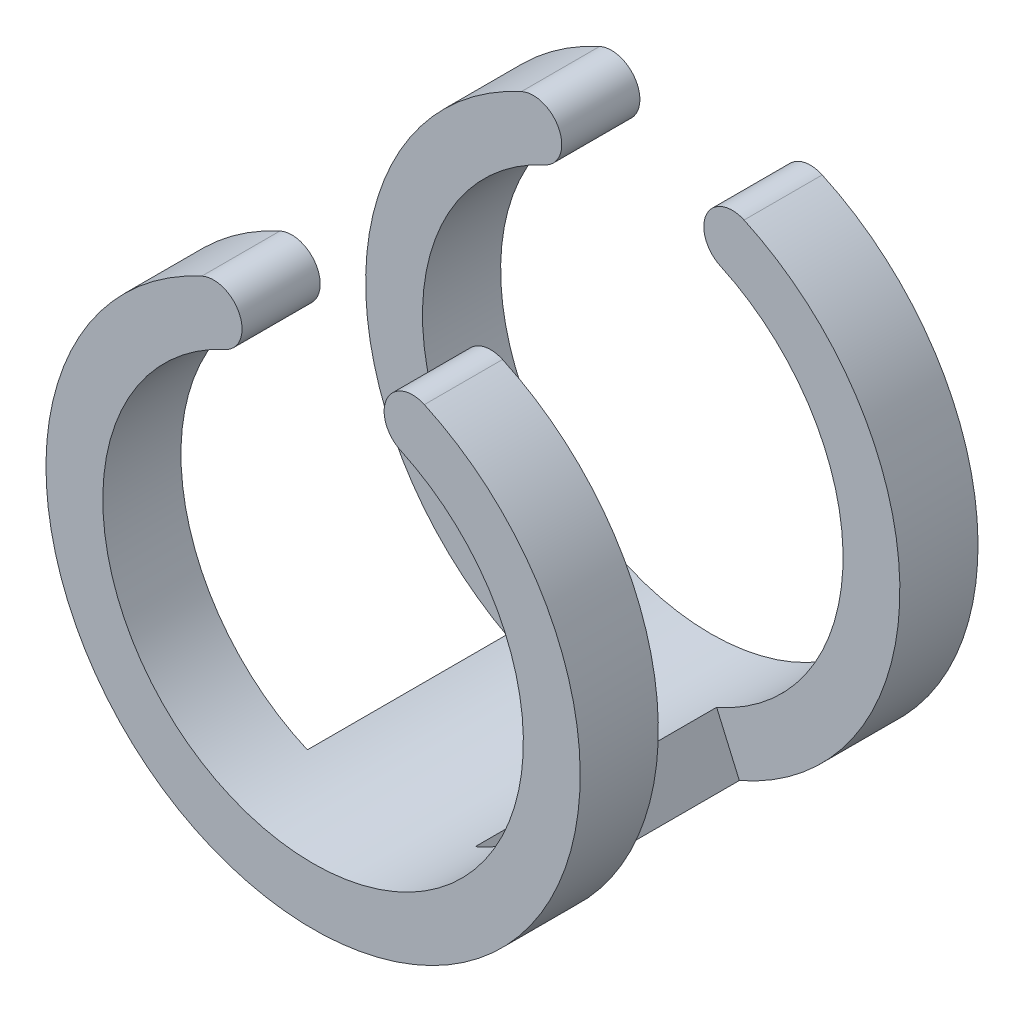
ISO-10303-21;
HEADER;
FILE_DESCRIPTION(('STEP AP214'),'2;1');
FILE_NAME('part.step','',(''),(''),'','','');
FILE_SCHEMA(('AUTOMOTIVE_DESIGN { 1 0 10303 214 1 1 1 1 }'));
ENDSEC;
DATA;
#1=APPLICATION_CONTEXT('core data for automotive mechanical design processes');
#2=APPLICATION_PROTOCOL_DEFINITION('international standard','automotive_design',2000,#1);
#3=PRODUCT_CONTEXT('',#1,'mechanical');
#4=PRODUCT('Part','Part','',(#3));
#5=PRODUCT_RELATED_PRODUCT_CATEGORY('part','',(#4));
#6=PRODUCT_DEFINITION_FORMATION('','',#4);
#7=PRODUCT_DEFINITION_CONTEXT('part definition',#1,'design');
#8=PRODUCT_DEFINITION('design','',#6,#7);
#9=PRODUCT_DEFINITION_SHAPE('','',#8);
#10=(LENGTH_UNIT() NAMED_UNIT(*) SI_UNIT(.MILLI.,.METRE.));
#11=(NAMED_UNIT(*) PLANE_ANGLE_UNIT() SI_UNIT($,.RADIAN.));
#12=(NAMED_UNIT(*) SI_UNIT($,.STERADIAN.) SOLID_ANGLE_UNIT());
#13=UNCERTAINTY_MEASURE_WITH_UNIT(LENGTH_MEASURE(1.E-05),#10,'distance_accuracy_value','');
#14=(GEOMETRIC_REPRESENTATION_CONTEXT(3) GLOBAL_UNCERTAINTY_ASSIGNED_CONTEXT((#13)) GLOBAL_UNIT_ASSIGNED_CONTEXT((#10,
#11,#12)) REPRESENTATION_CONTEXT('',''));
#15=CARTESIAN_POINT('',(0.,0.,0.));
#16=DIRECTION('',(0.,0.,1.));
#17=DIRECTION('',(1.,0.,0.));
#18=AXIS2_PLACEMENT_3D('',#15,#16,#17);
#19=CARTESIAN_POINT('',(-3.5,7.636098480245,7.));
#20=DIRECTION('',(0.,0.,-1.));
#21=DIRECTION('',(-1.,0.,0.));
#22=AXIS2_PLACEMENT_3D('',#19,#20,#21);
#23=CYLINDRICAL_SURFACE('',#22,0.999999999999999);
#24=CARTESIAN_POINT('',(-3.5,7.636098480245,-4.25));
#25=DIRECTION('',(0.,0.,1.));
#26=DIRECTION('',(1.,0.,0.));
#27=AXIS2_PLACEMENT_3D('',#24,#25,#26);
#28=CIRCLE('',#27,0.999999999999999);
#29=CARTESIAN_POINT('',(-3.08333333333334,6.72703913735869,-4.25));
#30=VERTEX_POINT('',#29);
#31=CARTESIAN_POINT('',(-3.91666666666667,8.54515782313131,-4.25));
#32=VERTEX_POINT('',#31);
#33=EDGE_CURVE('E198',#30,#32,#28,.T.);
#34=ORIENTED_EDGE('',*,*,#33,.F.);
#35=DIRECTION('',(0.,0.,-1.));
#36=VECTOR('',#35,1.);
#37=CARTESIAN_POINT('',(-3.08333333333333,6.72703913735869,7.));
#38=LINE('',#37,#36);
#39=CARTESIAN_POINT('',(-3.08333333333333,6.72703913735869,-7.));
#40=VERTEX_POINT('',#39);
#41=EDGE_CURVE('E157',#30,#40,#38,.T.);
#42=ORIENTED_EDGE('',*,*,#41,.T.);
#43=CARTESIAN_POINT('',(-3.5,7.636098480245,-7.));
#44=DIRECTION('',(0.,0.,1.));
#45=DIRECTION('',(-1.,0.,0.));
#46=AXIS2_PLACEMENT_3D('',#43,#44,#45);
#47=CIRCLE('',#46,0.999999999999999);
#48=CARTESIAN_POINT('',(-3.91666666666667,8.54515782313131,-7.));
#49=VERTEX_POINT('',#48);
#50=EDGE_CURVE('E165',#40,#49,#47,.T.);
#51=ORIENTED_EDGE('',*,*,#50,.T.);
#52=DIRECTION('',(0.,0.,-1.));
#53=VECTOR('',#52,1.);
#54=CARTESIAN_POINT('',(-3.91666666666667,8.54515782313131,7.));
#55=LINE('',#54,#53);
#56=EDGE_CURVE('E43',#32,#49,#55,.T.);
#57=ORIENTED_EDGE('',*,*,#56,.F.);
#58=EDGE_LOOP('',(#34,#42,#51,#57));
#59=FACE_BOUND('',#58,.T.);
#60=ADVANCED_FACE('F35',(#59),#23,.T.);
#61=CARTESIAN_POINT('',(0.,0.,7.));
#62=DIRECTION('',(0.,0.,-1.));
#63=DIRECTION('',(-1.,0.,0.));
#64=AXIS2_PLACEMENT_3D('',#61,#62,#63);
#65=CYLINDRICAL_SURFACE('',#64,9.4);
#66=CARTESIAN_POINT('',(0.,0.,-4.25));
#67=DIRECTION('',(0.,0.,1.));
#68=DIRECTION('',(1.,0.,0.));
#69=AXIS2_PLACEMENT_3D('',#66,#67,#68);
#70=CIRCLE('',#69,9.4);
#71=CARTESIAN_POINT('',(3.75,-8.6195997586895,-4.25));
#72=VERTEX_POINT('',#71);
#73=CARTESIAN_POINT('',(3.91666666666667,8.54515782313131,-4.25));
#74=VERTEX_POINT('',#73);
#75=EDGE_CURVE('E124',#72,#74,#70,.T.);
#76=ORIENTED_EDGE('',*,*,#75,.F.);
#77=DIRECTION('',(0.,0.,1.));
#78=VECTOR('',#77,1.);
#79=CARTESIAN_POINT('',(3.75,-8.6195997586895,-4.25));
#80=LINE('',#79,#78);
#81=CARTESIAN_POINT('',(3.75,-8.6195997586895,4.25));
#82=VERTEX_POINT('',#81);
#83=EDGE_CURVE('E168',#72,#82,#80,.T.);
#84=ORIENTED_EDGE('',*,*,#83,.T.);
#85=CARTESIAN_POINT('',(0.,0.,4.25));
#86=DIRECTION('',(0.,0.,1.));
#87=DIRECTION('',(1.,0.,0.));
#88=AXIS2_PLACEMENT_3D('',#85,#86,#87);
#89=CIRCLE('',#88,9.4);
#90=CARTESIAN_POINT('',(3.91666666666667,8.54515782313131,4.25));
#91=VERTEX_POINT('',#90);
#92=EDGE_CURVE('E183',#82,#91,#89,.T.);
#93=ORIENTED_EDGE('',*,*,#92,.T.);
#94=DIRECTION('',(0.,0.,-1.));
#95=VECTOR('',#94,1.);
#96=CARTESIAN_POINT('',(3.91666666666667,8.54515782313131,7.));
#97=LINE('',#96,#95);
#98=CARTESIAN_POINT('',(3.91666666666667,8.54515782313131,7.));
#99=VERTEX_POINT('',#98);
#100=EDGE_CURVE('E148',#99,#91,#97,.T.);
#101=ORIENTED_EDGE('',*,*,#100,.F.);
#102=CARTESIAN_POINT('',(0.,0.,7.));
#103=DIRECTION('',(0.,0.,1.));
#104=DIRECTION('',(1.,0.,0.));
#105=AXIS2_PLACEMENT_3D('',#102,#103,#104);
#106=CIRCLE('',#105,9.4);
#107=CARTESIAN_POINT('',(-3.91666666666667,8.54515782313131,7.));
#108=VERTEX_POINT('',#107);
#109=EDGE_CURVE('E173',#108,#99,#106,.T.);
#110=ORIENTED_EDGE('',*,*,#109,.F.);
#111=CARTESIAN_POINT('',(-3.91666666666667,8.54515782313131,4.25));
#112=VERTEX_POINT('',#111);
#113=EDGE_CURVE('E11',#108,#112,#55,.T.);
#114=ORIENTED_EDGE('',*,*,#113,.T.);
#115=CARTESIAN_POINT('',(0.,0.,4.25));
#116=DIRECTION('',(0.,0.,1.));
#117=DIRECTION('',(1.,0.,0.));
#118=AXIS2_PLACEMENT_3D('',#115,#116,#117);
#119=CIRCLE('',#118,9.4);
#120=CARTESIAN_POINT('',(-3.75,-8.6195997586895,4.25));
#121=VERTEX_POINT('',#120);
#122=EDGE_CURVE('E188',#112,#121,#119,.T.);
#123=ORIENTED_EDGE('',*,*,#122,.T.);
#124=DIRECTION('',(0.,0.,1.));
#125=VECTOR('',#124,1.);
#126=CARTESIAN_POINT('',(-3.75,-8.6195997586895,-4.25));
#127=LINE('',#126,#125);
#128=CARTESIAN_POINT('',(-3.75,-8.6195997586895,-4.25));
#129=VERTEX_POINT('',#128);
#130=EDGE_CURVE('E177',#129,#121,#127,.T.);
#131=ORIENTED_EDGE('',*,*,#130,.F.);
#132=CARTESIAN_POINT('',(0.,0.,-4.25));
#133=DIRECTION('',(0.,0.,1.));
#134=DIRECTION('',(1.,0.,0.));
#135=AXIS2_PLACEMENT_3D('',#132,#133,#134);
#136=CIRCLE('',#135,9.4);
#137=EDGE_CURVE('E196',#32,#129,#136,.T.);
#138=ORIENTED_EDGE('',*,*,#137,.F.);
#139=ORIENTED_EDGE('',*,*,#56,.T.);
#140=CARTESIAN_POINT('',(0.,0.,-7.));
#141=DIRECTION('',(0.,0.,1.));
#142=DIRECTION('',(1.,0.,0.));
#143=AXIS2_PLACEMENT_3D('',#140,#141,#142);
#144=CIRCLE('',#143,9.4);
#145=CARTESIAN_POINT('',(3.91666666666667,8.54515782313131,-7.));
#146=VERTEX_POINT('',#145);
#147=EDGE_CURVE('E146',#49,#146,#144,.T.);
#148=ORIENTED_EDGE('',*,*,#147,.T.);
#149=EDGE_CURVE('E139',#74,#146,#97,.T.);
#150=ORIENTED_EDGE('',*,*,#149,.F.);
#151=EDGE_LOOP('',(#76,#84,#93,#101,#110,#114,#123,#131,#138,#139,#148,#150));
#152=FACE_BOUND('',#151,.T.);
#153=ADVANCED_FACE('F144',(#152),#65,.T.);
#154=CARTESIAN_POINT('',(3.5,7.636098480245,7.));
#155=DIRECTION('',(0.,0.,-1.));
#156=DIRECTION('',(-1.,0.,0.));
#157=AXIS2_PLACEMENT_3D('',#154,#155,#156);
#158=CYLINDRICAL_SURFACE('',#157,0.999999999999999);
#159=CARTESIAN_POINT('',(3.5,7.636098480245,-4.25));
#160=DIRECTION('',(0.,0.,1.));
#161=DIRECTION('',(1.,0.,0.));
#162=AXIS2_PLACEMENT_3D('',#159,#160,#161);
#163=CIRCLE('',#162,1.);
#164=CARTESIAN_POINT('',(3.08333333333333,6.72703913735869,-4.25));
#165=VERTEX_POINT('',#164);
#166=EDGE_CURVE('E127',#74,#165,#163,.T.);
#167=ORIENTED_EDGE('',*,*,#166,.F.);
#168=ORIENTED_EDGE('',*,*,#149,.T.);
#169=CARTESIAN_POINT('',(3.5,7.636098480245,-7.));
#170=DIRECTION('',(0.,0.,1.));
#171=DIRECTION('',(1.,0.,0.));
#172=AXIS2_PLACEMENT_3D('',#169,#170,#171);
#173=CIRCLE('',#172,0.999999999999999);
#174=CARTESIAN_POINT('',(3.08333333333333,6.72703913735869,-7.));
#175=VERTEX_POINT('',#174);
#176=EDGE_CURVE('E162',#146,#175,#173,.T.);
#177=ORIENTED_EDGE('',*,*,#176,.T.);
#178=DIRECTION('',(0.,0.,-1.));
#179=VECTOR('',#178,1.);
#180=CARTESIAN_POINT('',(3.08333333333333,6.72703913735869,7.));
#181=LINE('',#180,#179);
#182=EDGE_CURVE('E141',#165,#175,#181,.T.);
#183=ORIENTED_EDGE('',*,*,#182,.F.);
#184=EDGE_LOOP('',(#167,#168,#177,#183));
#185=FACE_BOUND('',#184,.T.);
#186=ADVANCED_FACE('F137',(#185),#158,.T.);
#187=CARTESIAN_POINT('',(0.,0.,7.));
#188=DIRECTION('',(0.,0.,-1.));
#189=DIRECTION('',(-1.,0.,0.));
#190=AXIS2_PLACEMENT_3D('',#187,#188,#189);
#191=CYLINDRICAL_SURFACE('',#190,7.4);
#192=CARTESIAN_POINT('',(0.,0.,-4.25));
#193=DIRECTION('',(0.,0.,-1.));
#194=DIRECTION('',(1.,0.,0.));
#195=AXIS2_PLACEMENT_3D('',#192,#193,#194);
#196=CIRCLE('',#195,7.4);
#197=CARTESIAN_POINT('',(2.95212765957447,-6.78564236322365,-4.25));
#198=VERTEX_POINT('',#197);
#199=EDGE_CURVE('E142',#165,#198,#196,.T.);
#200=ORIENTED_EDGE('',*,*,#199,.F.);
#201=ORIENTED_EDGE('',*,*,#182,.T.);
#202=CARTESIAN_POINT('',(0.,0.,-7.));
#203=DIRECTION('',(0.,0.,-1.));
#204=DIRECTION('',(1.,0.,0.));
#205=AXIS2_PLACEMENT_3D('',#202,#203,#204);
#206=CIRCLE('',#205,7.4);
#207=EDGE_CURVE('E158',#175,#40,#206,.T.);
#208=ORIENTED_EDGE('',*,*,#207,.T.);
#209=ORIENTED_EDGE('',*,*,#41,.F.);
#210=CARTESIAN_POINT('',(0.,0.,-4.25));
#211=DIRECTION('',(0.,0.,-1.));
#212=DIRECTION('',(1.,0.,0.));
#213=AXIS2_PLACEMENT_3D('',#210,#211,#212);
#214=CIRCLE('',#213,7.4);
#215=CARTESIAN_POINT('',(-2.95212765957447,-6.78564236322365,-4.25));
#216=VERTEX_POINT('',#215);
#217=EDGE_CURVE('E187',#216,#30,#214,.T.);
#218=ORIENTED_EDGE('',*,*,#217,.F.);
#219=DIRECTION('',(0.,0.,1.));
#220=VECTOR('',#219,1.);
#221=CARTESIAN_POINT('',(-2.95212765957447,-6.78564236322365,-4.25));
#222=LINE('',#221,#220);
#223=CARTESIAN_POINT('',(-2.95212765957447,-6.78564236322365,4.25));
#224=VERTEX_POINT('',#223);
#225=EDGE_CURVE('E179',#216,#224,#222,.T.);
#226=ORIENTED_EDGE('',*,*,#225,.T.);
#227=CARTESIAN_POINT('',(0.,0.,4.25));
#228=DIRECTION('',(0.,0.,-1.));
#229=DIRECTION('',(1.,0.,0.));
#230=AXIS2_PLACEMENT_3D('',#227,#228,#229);
#231=CIRCLE('',#230,7.4);
#232=CARTESIAN_POINT('',(-3.08333333333333,6.72703913735869,4.25));
#233=VERTEX_POINT('',#232);
#234=EDGE_CURVE('E192',#224,#233,#231,.T.);
#235=ORIENTED_EDGE('',*,*,#234,.T.);
#236=CARTESIAN_POINT('',(-3.08333333333333,6.72703913735869,7.));
#237=VERTEX_POINT('',#236);
#238=EDGE_CURVE('E154',#237,#233,#38,.T.);
#239=ORIENTED_EDGE('',*,*,#238,.F.);
#240=CARTESIAN_POINT('',(0.,0.,7.));
#241=DIRECTION('',(0.,0.,-1.));
#242=DIRECTION('',(1.,0.,0.));
#243=AXIS2_PLACEMENT_3D('',#240,#241,#242);
#244=CIRCLE('',#243,7.4);
#245=CARTESIAN_POINT('',(3.08333333333333,6.72703913735869,7.));
#246=VERTEX_POINT('',#245);
#247=EDGE_CURVE('E169',#246,#237,#244,.T.);
#248=ORIENTED_EDGE('',*,*,#247,.F.);
#249=CARTESIAN_POINT('',(3.08333333333333,6.72703913735869,4.25));
#250=VERTEX_POINT('',#249);
#251=EDGE_CURVE('E149',#246,#250,#181,.T.);
#252=ORIENTED_EDGE('',*,*,#251,.T.);
#253=CARTESIAN_POINT('',(0.,0.,4.25));
#254=DIRECTION('',(0.,0.,-1.));
#255=DIRECTION('',(1.,0.,0.));
#256=AXIS2_PLACEMENT_3D('',#253,#254,#255);
#257=CIRCLE('',#256,7.4);
#258=CARTESIAN_POINT('',(2.95212765957447,-6.78564236322365,4.25));
#259=VERTEX_POINT('',#258);
#260=EDGE_CURVE('E205',#250,#259,#257,.T.);
#261=ORIENTED_EDGE('',*,*,#260,.T.);
#262=DIRECTION('',(0.,0.,1.));
#263=VECTOR('',#262,1.);
#264=CARTESIAN_POINT('',(2.95212765957447,-6.78564236322365,-4.25));
#265=LINE('',#264,#263);
#266=EDGE_CURVE('E201',#198,#259,#265,.T.);
#267=ORIENTED_EDGE('',*,*,#266,.F.);
#268=EDGE_LOOP('',(#200,#201,#208,#209,#218,#226,#235,#239,#248,#252,#261,#267));
#269=FACE_BOUND('',#268,.T.);
#270=ADVANCED_FACE('F218',(#269),#191,.F.);
#271=ORIENTED_EDGE('',*,*,#238,.T.);
#272=CARTESIAN_POINT('',(-3.5,7.636098480245,4.25));
#273=DIRECTION('',(0.,0.,1.));
#274=DIRECTION('',(1.,0.,0.));
#275=AXIS2_PLACEMENT_3D('',#272,#273,#274);
#276=CIRCLE('',#275,0.999999999999999);
#277=EDGE_CURVE('E58',#233,#112,#276,.T.);
#278=ORIENTED_EDGE('',*,*,#277,.T.);
#279=ORIENTED_EDGE('',*,*,#113,.F.);
#280=CARTESIAN_POINT('',(-3.5,7.636098480245,7.));
#281=DIRECTION('',(0.,0.,1.));
#282=DIRECTION('',(-1.,0.,0.));
#283=AXIS2_PLACEMENT_3D('',#280,#281,#282);
#284=CIRCLE('',#283,0.999999999999999);
#285=EDGE_CURVE('E161',#237,#108,#284,.T.);
#286=ORIENTED_EDGE('',*,*,#285,.F.);
#287=EDGE_LOOP('',(#271,#278,#279,#286));
#288=FACE_BOUND('',#287,.T.);
#289=ADVANCED_FACE('F37',(#288),#23,.T.);
#290=ORIENTED_EDGE('',*,*,#100,.T.);
#291=CARTESIAN_POINT('',(3.5,7.636098480245,4.25));
#292=DIRECTION('',(0.,0.,1.));
#293=DIRECTION('',(1.,0.,0.));
#294=AXIS2_PLACEMENT_3D('',#291,#292,#293);
#295=CIRCLE('',#294,1.);
#296=EDGE_CURVE('E208',#91,#250,#295,.T.);
#297=ORIENTED_EDGE('',*,*,#296,.T.);
#298=ORIENTED_EDGE('',*,*,#251,.F.);
#299=CARTESIAN_POINT('',(3.5,7.636098480245,7.));
#300=DIRECTION('',(0.,0.,1.));
#301=DIRECTION('',(1.,0.,0.));
#302=AXIS2_PLACEMENT_3D('',#299,#300,#301);
#303=CIRCLE('',#302,0.999999999999999);
#304=EDGE_CURVE('E171',#99,#246,#303,.T.);
#305=ORIENTED_EDGE('',*,*,#304,.F.);
#306=EDGE_LOOP('',(#290,#297,#298,#305));
#307=FACE_BOUND('',#306,.T.);
#308=ADVANCED_FACE('F223',(#307),#158,.T.);
#309=CARTESIAN_POINT('',(-1.75,3.8180492401225,7.));
#310=DIRECTION('',(0.,0.,-1.));
#311=DIRECTION('',(-1.,0.,0.));
#312=AXIS2_PLACEMENT_3D('',#309,#310,#311);
#313=PLANE('',#312);
#314=ORIENTED_EDGE('',*,*,#285,.T.);
#315=ORIENTED_EDGE('',*,*,#109,.T.);
#316=ORIENTED_EDGE('',*,*,#304,.T.);
#317=ORIENTED_EDGE('',*,*,#247,.T.);
#318=EDGE_LOOP('',(#314,#315,#316,#317));
#319=FACE_BOUND('',#318,.T.);
#320=ADVANCED_FACE('F229',(#319),#313,.F.);
#321=CARTESIAN_POINT('',(-1.75,3.8180492401225,-7.));
#322=DIRECTION('',(0.,0.,-1.));
#323=DIRECTION('',(-1.,0.,0.));
#324=AXIS2_PLACEMENT_3D('',#321,#322,#323);
#325=PLANE('',#324);
#326=ORIENTED_EDGE('',*,*,#50,.F.);
#327=ORIENTED_EDGE('',*,*,#207,.F.);
#328=ORIENTED_EDGE('',*,*,#176,.F.);
#329=ORIENTED_EDGE('',*,*,#147,.F.);
#330=EDGE_LOOP('',(#326,#327,#328,#329));
#331=FACE_BOUND('',#330,.T.);
#332=ADVANCED_FACE('F248',(#331),#325,.T.);
#333=CARTESIAN_POINT('',(-2.95212765957447,-6.78564236322365,-4.25));
#334=DIRECTION('',(0.916978697732925,-0.398936170212766,0.));
#335=DIRECTION('',(0.398936170212766,0.916978697732925,0.));
#336=AXIS2_PLACEMENT_3D('',#333,#334,#335);
#337=PLANE('',#336);
#338=DIRECTION('',(0.398936170212766,0.916978697732925,0.));
#339=VECTOR('',#338,1.);
#340=CARTESIAN_POINT('',(-2.95212765957447,-6.78564236322365,4.25));
#341=LINE('',#340,#339);
#342=EDGE_CURVE('E184',#121,#224,#341,.T.);
#343=ORIENTED_EDGE('',*,*,#342,.T.);
#344=ORIENTED_EDGE('',*,*,#225,.F.);
#345=DIRECTION('',(0.398936170212766,0.916978697732925,0.));
#346=VECTOR('',#345,1.);
#347=CARTESIAN_POINT('',(-2.95212765957447,-6.78564236322365,-4.25));
#348=LINE('',#347,#346);
#349=EDGE_CURVE('E180',#129,#216,#348,.T.);
#350=ORIENTED_EDGE('',*,*,#349,.F.);
#351=ORIENTED_EDGE('',*,*,#130,.T.);
#352=EDGE_LOOP('',(#343,#344,#350,#351));
#353=FACE_BOUND('',#352,.T.);
#354=ADVANCED_FACE('F236',(#353),#337,.F.);
#355=CARTESIAN_POINT('',(0.,0.,-4.25));
#356=DIRECTION('',(0.,0.,1.));
#357=DIRECTION('',(1.,0.,0.));
#358=AXIS2_PLACEMENT_3D('',#355,#356,#357);
#359=PLANE('',#358);
#360=ORIENTED_EDGE('',*,*,#217,.T.);
#361=ORIENTED_EDGE('',*,*,#33,.T.);
#362=ORIENTED_EDGE('',*,*,#137,.T.);
#363=ORIENTED_EDGE('',*,*,#349,.T.);
#364=EDGE_LOOP('',(#360,#361,#362,#363));
#365=FACE_BOUND('',#364,.T.);
#366=ADVANCED_FACE('F249',(#365),#359,.T.);
#367=CARTESIAN_POINT('',(0.,0.,4.25));
#368=DIRECTION('',(0.,0.,1.));
#369=DIRECTION('',(1.,0.,0.));
#370=AXIS2_PLACEMENT_3D('',#367,#368,#369);
#371=PLANE('',#370);
#372=ORIENTED_EDGE('',*,*,#234,.F.);
#373=ORIENTED_EDGE('',*,*,#342,.F.);
#374=ORIENTED_EDGE('',*,*,#122,.F.);
#375=ORIENTED_EDGE('',*,*,#277,.F.);
#376=EDGE_LOOP('',(#372,#373,#374,#375));
#377=FACE_BOUND('',#376,.T.);
#378=ADVANCED_FACE('F234',(#377),#371,.F.);
#379=CARTESIAN_POINT('',(2.95212765957447,-6.78564236322365,-4.25));
#380=DIRECTION('',(-0.916978697732925,-0.398936170212766,0.));
#381=DIRECTION('',(0.398936170212766,-0.916978697732925,0.));
#382=AXIS2_PLACEMENT_3D('',#379,#380,#381);
#383=PLANE('',#382);
#384=DIRECTION('',(0.398936170212766,-0.916978697732925,0.));
#385=VECTOR('',#384,1.);
#386=CARTESIAN_POINT('',(2.95212765957447,-6.78564236322365,4.25));
#387=LINE('',#386,#385);
#388=EDGE_CURVE('E50',#259,#82,#387,.T.);
#389=ORIENTED_EDGE('',*,*,#388,.T.);
#390=ORIENTED_EDGE('',*,*,#83,.F.);
#391=DIRECTION('',(0.398936170212766,-0.916978697732925,0.));
#392=VECTOR('',#391,1.);
#393=CARTESIAN_POINT('',(2.95212765957447,-6.78564236322365,-4.25));
#394=LINE('',#393,#392);
#395=EDGE_CURVE('E130',#198,#72,#394,.T.);
#396=ORIENTED_EDGE('',*,*,#395,.F.);
#397=ORIENTED_EDGE('',*,*,#266,.T.);
#398=EDGE_LOOP('',(#389,#390,#396,#397));
#399=FACE_BOUND('',#398,.T.);
#400=ADVANCED_FACE('F217',(#399),#383,.F.);
#401=CARTESIAN_POINT('',(0.,0.,-4.25));
#402=DIRECTION('',(0.,0.,1.));
#403=DIRECTION('',(1.,0.,0.));
#404=AXIS2_PLACEMENT_3D('',#401,#402,#403);
#405=PLANE('',#404);
#406=ORIENTED_EDGE('',*,*,#75,.T.);
#407=ORIENTED_EDGE('',*,*,#166,.T.);
#408=ORIENTED_EDGE('',*,*,#199,.T.);
#409=ORIENTED_EDGE('',*,*,#395,.T.);
#410=EDGE_LOOP('',(#406,#407,#408,#409));
#411=FACE_BOUND('',#410,.T.);
#412=ADVANCED_FACE('F126',(#411),#405,.T.);
#413=CARTESIAN_POINT('',(0.,0.,4.25));
#414=DIRECTION('',(0.,0.,1.));
#415=DIRECTION('',(1.,0.,0.));
#416=AXIS2_PLACEMENT_3D('',#413,#414,#415);
#417=PLANE('',#416);
#418=ORIENTED_EDGE('',*,*,#92,.F.);
#419=ORIENTED_EDGE('',*,*,#388,.F.);
#420=ORIENTED_EDGE('',*,*,#260,.F.);
#421=ORIENTED_EDGE('',*,*,#296,.F.);
#422=EDGE_LOOP('',(#418,#419,#420,#421));
#423=FACE_BOUND('',#422,.T.);
#424=ADVANCED_FACE('F221',(#423),#417,.F.);
#425=CLOSED_SHELL('',(#60,#153,#186,#270,#289,#308,#320,#332,#354,#366,#378,#400,#412,#424));
#426=MANIFOLD_SOLID_BREP('B2',#425);
#427=ADVANCED_BREP_SHAPE_REPRESENTATION('',(#18,#426),#14);
#428=SHAPE_DEFINITION_REPRESENTATION(#9,#427);
ENDSEC;
END-ISO-10303-21;
